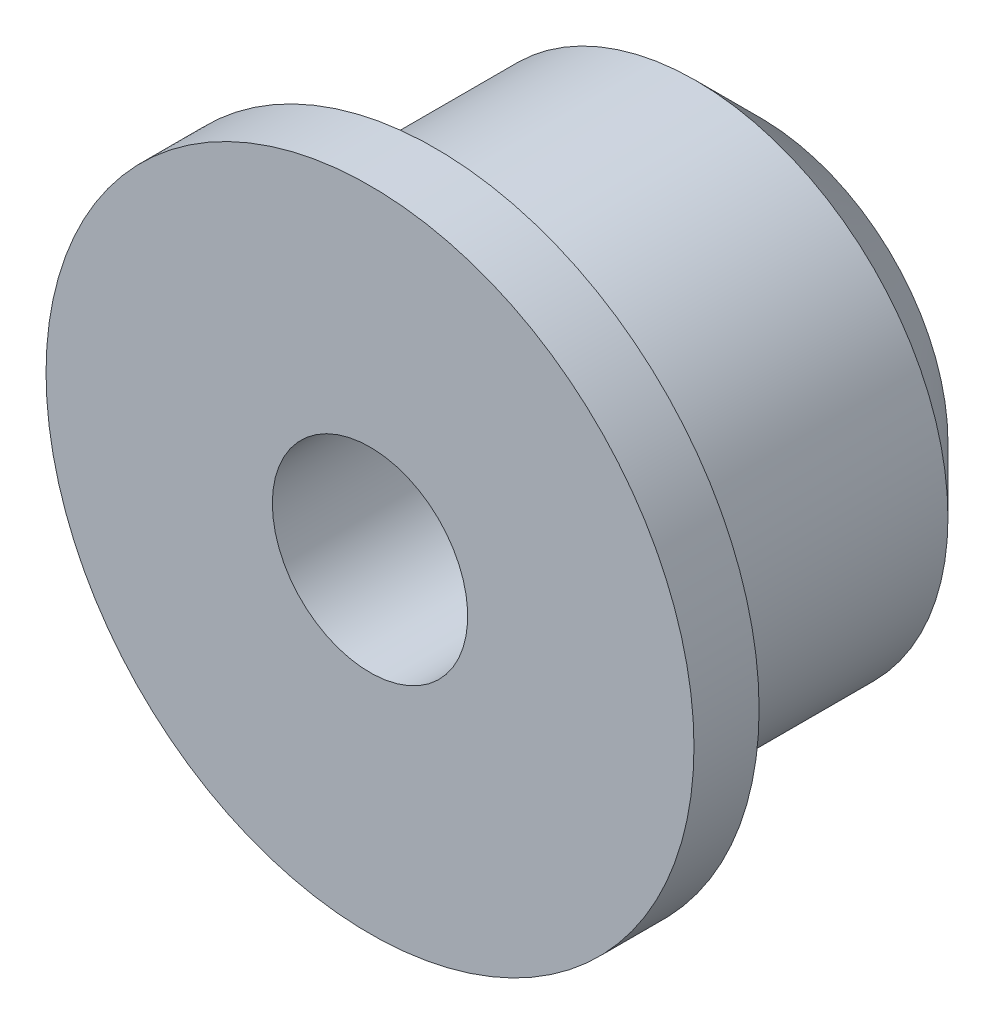
ISO-10303-21;
HEADER;
FILE_DESCRIPTION(('STEP AP214'),'2;1');
FILE_NAME('part.step','',(''),(''),'','','');
FILE_SCHEMA(('AUTOMOTIVE_DESIGN { 1 0 10303 214 1 1 1 1 }'));
ENDSEC;
DATA;
#1=APPLICATION_CONTEXT('core data for automotive mechanical design processes');
#2=APPLICATION_PROTOCOL_DEFINITION('international standard','automotive_design',2000,#1);
#3=PRODUCT_CONTEXT('',#1,'mechanical');
#4=PRODUCT('Part','Part','',(#3));
#5=PRODUCT_RELATED_PRODUCT_CATEGORY('part','',(#4));
#6=PRODUCT_DEFINITION_FORMATION('','',#4);
#7=PRODUCT_DEFINITION_CONTEXT('part definition',#1,'design');
#8=PRODUCT_DEFINITION('design','',#6,#7);
#9=PRODUCT_DEFINITION_SHAPE('','',#8);
#10=(LENGTH_UNIT() NAMED_UNIT(*) SI_UNIT(.MILLI.,.METRE.));
#11=(NAMED_UNIT(*) PLANE_ANGLE_UNIT() SI_UNIT($,.RADIAN.));
#12=(NAMED_UNIT(*) SI_UNIT($,.STERADIAN.) SOLID_ANGLE_UNIT());
#13=UNCERTAINTY_MEASURE_WITH_UNIT(LENGTH_MEASURE(1.E-05),#10,'distance_accuracy_value','');
#14=(GEOMETRIC_REPRESENTATION_CONTEXT(3) GLOBAL_UNCERTAINTY_ASSIGNED_CONTEXT((#13)) GLOBAL_UNIT_ASSIGNED_CONTEXT((#10,
#11,#12)) REPRESENTATION_CONTEXT('',''));
#15=CARTESIAN_POINT('',(0.,0.,0.));
#16=DIRECTION('',(0.,0.,1.));
#17=DIRECTION('',(1.,0.,0.));
#18=AXIS2_PLACEMENT_3D('',#15,#16,#17);
#19=CARTESIAN_POINT('',(0.,0.,12.));
#20=DIRECTION('',(0.,0.,-1.));
#21=DIRECTION('',(-1.,0.,0.));
#22=AXIS2_PLACEMENT_3D('',#19,#20,#21);
#23=CYLINDRICAL_SURFACE('',#22,7.75);
#24=CARTESIAN_POINT('',(0.,0.,2.));
#25=DIRECTION('',(0.,0.,1.));
#26=DIRECTION('',(1.,0.,0.));
#27=AXIS2_PLACEMENT_3D('',#24,#25,#26);
#28=CIRCLE('',#27,7.75);
#29=CARTESIAN_POINT('',(7.75,0.,2.));
#30=VERTEX_POINT('',#29);
#31=EDGE_CURVE('E40',#30,#30,#28,.T.);
#32=ORIENTED_EDGE('',*,*,#31,.T.);
#33=EDGE_LOOP('',(#32));
#34=FACE_BOUND('',#33,.T.);
#35=CARTESIAN_POINT('',(0.,0.,10.));
#36=DIRECTION('',(0.,0.,1.));
#37=DIRECTION('',(1.,0.,0.));
#38=AXIS2_PLACEMENT_3D('',#35,#36,#37);
#39=CIRCLE('',#38,7.75);
#40=CARTESIAN_POINT('',(7.75,0.,10.));
#41=VERTEX_POINT('',#40);
#42=EDGE_CURVE('E44',#41,#41,#39,.T.);
#43=ORIENTED_EDGE('',*,*,#42,.F.);
#44=EDGE_LOOP('',(#43));
#45=FACE_BOUND('',#44,.T.);
#46=ADVANCED_FACE('F33',(#34,#45),#23,.T.);
#47=CARTESIAN_POINT('',(0.,0.,12.));
#48=DIRECTION('',(0.,0.,1.));
#49=DIRECTION('',(1.,0.,0.));
#50=AXIS2_PLACEMENT_3D('',#47,#48,#49);
#51=PLANE('',#50);
#52=CARTESIAN_POINT('',(0.,0.,12.));
#53=DIRECTION('',(0.,0.,-1.));
#54=DIRECTION('',(-1.,0.,0.));
#55=AXIS2_PLACEMENT_3D('',#52,#53,#54);
#56=CIRCLE('',#55,3.);
#57=CARTESIAN_POINT('',(-3.,0.,12.));
#58=VERTEX_POINT('',#57);
#59=EDGE_CURVE('E54',#58,#58,#56,.T.);
#60=ORIENTED_EDGE('',*,*,#59,.T.);
#61=EDGE_LOOP('',(#60));
#62=FACE_BOUND('',#61,.T.);
#63=CARTESIAN_POINT('',(0.,0.,12.));
#64=DIRECTION('',(0.,0.,1.));
#65=DIRECTION('',(1.,0.,0.));
#66=AXIS2_PLACEMENT_3D('',#63,#64,#65);
#67=CIRCLE('',#66,9.95);
#68=CARTESIAN_POINT('',(9.95,0.,12.));
#69=VERTEX_POINT('',#68);
#70=EDGE_CURVE('E51',#69,#69,#67,.T.);
#71=ORIENTED_EDGE('',*,*,#70,.T.);
#72=EDGE_LOOP('',(#71));
#73=FACE_BOUND('',#72,.T.);
#74=ADVANCED_FACE('F63',(#62,#73),#51,.T.);
#75=CARTESIAN_POINT('',(0.,0.,0.));
#76=DIRECTION('',(0.,0.,1.));
#77=DIRECTION('',(1.,0.,0.));
#78=AXIS2_PLACEMENT_3D('',#75,#76,#77);
#79=PLANE('',#78);
#80=CARTESIAN_POINT('',(0.,0.,0.));
#81=DIRECTION('',(0.,0.,-1.));
#82=DIRECTION('',(-1.,0.,0.));
#83=AXIS2_PLACEMENT_3D('',#80,#81,#82);
#84=CIRCLE('',#83,3.);
#85=CARTESIAN_POINT('',(-3.,0.,0.));
#86=VERTEX_POINT('',#85);
#87=EDGE_CURVE('E57',#86,#86,#84,.T.);
#88=ORIENTED_EDGE('',*,*,#87,.F.);
#89=EDGE_LOOP('',(#88));
#90=FACE_BOUND('',#89,.T.);
#91=CARTESIAN_POINT('',(0.,0.,0.));
#92=DIRECTION('',(0.,0.,1.));
#93=DIRECTION('',(1.,0.,0.));
#94=AXIS2_PLACEMENT_3D('',#91,#92,#93);
#95=CIRCLE('',#94,5.74999999999999);
#96=CARTESIAN_POINT('',(5.74999999999999,0.,0.));
#97=VERTEX_POINT('',#96);
#98=EDGE_CURVE('E10',#97,#97,#95,.F.);
#99=ORIENTED_EDGE('',*,*,#98,.T.);
#100=EDGE_LOOP('',(#99));
#101=FACE_BOUND('',#100,.T.);
#102=ADVANCED_FACE('F72',(#90,#101),#79,.F.);
#103=CARTESIAN_POINT('',(0.,0.,10.));
#104=DIRECTION('',(0.,0.,1.));
#105=DIRECTION('',(1.,0.,0.));
#106=AXIS2_PLACEMENT_3D('',#103,#104,#105);
#107=PLANE('',#106);
#108=CARTESIAN_POINT('',(0.,0.,10.));
#109=DIRECTION('',(0.,0.,1.));
#110=DIRECTION('',(1.,0.,0.));
#111=AXIS2_PLACEMENT_3D('',#108,#109,#110);
#112=CIRCLE('',#111,9.95);
#113=CARTESIAN_POINT('',(9.95,0.,10.));
#114=VERTEX_POINT('',#113);
#115=EDGE_CURVE('E48',#114,#114,#112,.T.);
#116=ORIENTED_EDGE('',*,*,#115,.F.);
#117=EDGE_LOOP('',(#116));
#118=FACE_BOUND('',#117,.T.);
#119=ORIENTED_EDGE('',*,*,#42,.T.);
#120=EDGE_LOOP('',(#119));
#121=FACE_BOUND('',#120,.T.);
#122=ADVANCED_FACE('F74',(#118,#121),#107,.F.);
#123=CARTESIAN_POINT('',(0.,0.,10.));
#124=DIRECTION('',(0.,0.,1.));
#125=DIRECTION('',(1.,0.,0.));
#126=AXIS2_PLACEMENT_3D('',#123,#124,#125);
#127=CYLINDRICAL_SURFACE('',#126,9.95);
#128=ORIENTED_EDGE('',*,*,#115,.T.);
#129=EDGE_LOOP('',(#128));
#130=FACE_BOUND('',#129,.T.);
#131=ORIENTED_EDGE('',*,*,#70,.F.);
#132=EDGE_LOOP('',(#131));
#133=FACE_BOUND('',#132,.T.);
#134=ADVANCED_FACE('F80',(#130,#133),#127,.T.);
#135=CARTESIAN_POINT('',(0.,0.,2.));
#136=DIRECTION('',(0.,0.,1.));
#137=DIRECTION('',(1.,0.,0.));
#138=AXIS2_PLACEMENT_3D('',#135,#136,#137);
#139=CONICAL_SURFACE('',#138,7.75,0.78539816339745);
#140=ORIENTED_EDGE('',*,*,#98,.F.);
#141=EDGE_LOOP('',(#140));
#142=FACE_BOUND('',#141,.T.);
#143=ORIENTED_EDGE('',*,*,#31,.F.);
#144=EDGE_LOOP('',(#143));
#145=FACE_BOUND('',#144,.T.);
#146=ADVANCED_FACE('F35',(#142,#145),#139,.T.);
#147=CARTESIAN_POINT('',(0.,0.,12.));
#148=DIRECTION('',(0.,0.,-1.));
#149=DIRECTION('',(-1.,0.,0.));
#150=AXIS2_PLACEMENT_3D('',#147,#148,#149);
#151=CYLINDRICAL_SURFACE('',#150,3.);
#152=ORIENTED_EDGE('',*,*,#59,.F.);
#153=EDGE_LOOP('',(#152));
#154=FACE_BOUND('',#153,.T.);
#155=ORIENTED_EDGE('',*,*,#87,.T.);
#156=EDGE_LOOP('',(#155));
#157=FACE_BOUND('',#156,.T.);
#158=ADVANCED_FACE('F66',(#154,#157),#151,.F.);
#159=CLOSED_SHELL('',(#46,#74,#102,#122,#134,#146,#158));
#160=MANIFOLD_SOLID_BREP('B2',#159);
#161=ADVANCED_BREP_SHAPE_REPRESENTATION('',(#18,#160),#14);
#162=SHAPE_DEFINITION_REPRESENTATION(#9,#161);
ENDSEC;
END-ISO-10303-21;
